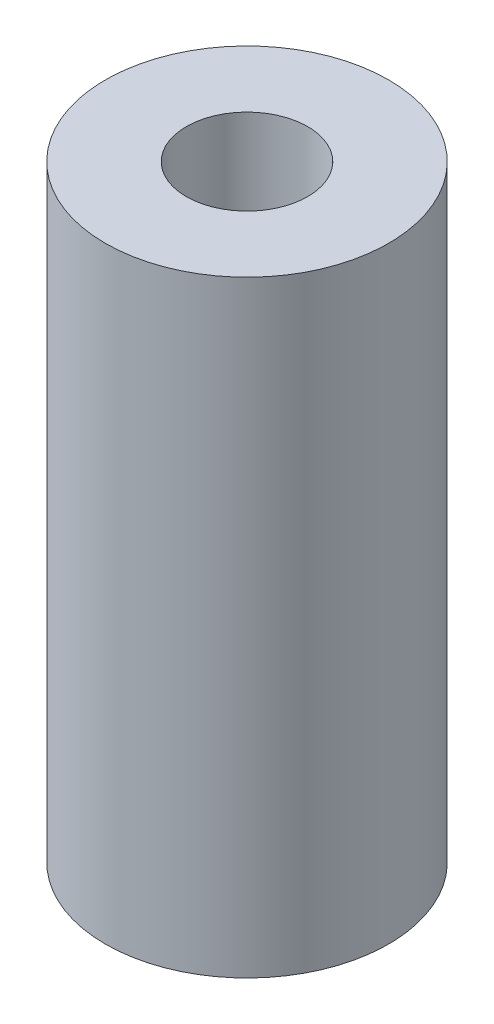
ISO-10303-21;
HEADER;
FILE_DESCRIPTION(('STEP AP214'),'2;1');
FILE_NAME('part.step','',(''),(''),'','','');
FILE_SCHEMA(('AUTOMOTIVE_DESIGN { 1 0 10303 214 1 1 1 1 }'));
ENDSEC;
DATA;
#1=APPLICATION_CONTEXT('core data for automotive mechanical design processes');
#2=APPLICATION_PROTOCOL_DEFINITION('international standard','automotive_design',2000,#1);
#3=PRODUCT_CONTEXT('',#1,'mechanical');
#4=PRODUCT('Part','Part','',(#3));
#5=PRODUCT_RELATED_PRODUCT_CATEGORY('part','',(#4));
#6=PRODUCT_DEFINITION_FORMATION('','',#4);
#7=PRODUCT_DEFINITION_CONTEXT('part definition',#1,'design');
#8=PRODUCT_DEFINITION('design','',#6,#7);
#9=PRODUCT_DEFINITION_SHAPE('','',#8);
#10=(LENGTH_UNIT() NAMED_UNIT(*) SI_UNIT(.MILLI.,.METRE.));
#11=(NAMED_UNIT(*) PLANE_ANGLE_UNIT() SI_UNIT($,.RADIAN.));
#12=(NAMED_UNIT(*) SI_UNIT($,.STERADIAN.) SOLID_ANGLE_UNIT());
#13=UNCERTAINTY_MEASURE_WITH_UNIT(LENGTH_MEASURE(1.E-05),#10,'distance_accuracy_value','');
#14=(GEOMETRIC_REPRESENTATION_CONTEXT(3) GLOBAL_UNCERTAINTY_ASSIGNED_CONTEXT((#13)) GLOBAL_UNIT_ASSIGNED_CONTEXT((#10,
#11,#12)) REPRESENTATION_CONTEXT('',''));
#15=CARTESIAN_POINT('',(0.,0.,0.));
#16=DIRECTION('',(0.,0.,1.));
#17=DIRECTION('',(1.,0.,0.));
#18=AXIS2_PLACEMENT_3D('',#15,#16,#17);
#19=CARTESIAN_POINT('',(0.,15.,0.));
#20=DIRECTION('',(0.,1.,0.));
#21=DIRECTION('',(0.,0.,1.));
#22=AXIS2_PLACEMENT_3D('',#19,#20,#21);
#23=PLANE('',#22);
#24=CARTESIAN_POINT('',(0.,15.,0.));
#25=DIRECTION('',(0.,1.,0.));
#26=DIRECTION('',(0.,0.,1.));
#27=AXIS2_PLACEMENT_3D('',#24,#25,#26);
#28=CIRCLE('',#27,3.5);
#29=CARTESIAN_POINT('',(0.,15.,3.5));
#30=VERTEX_POINT('',#29);
#31=EDGE_CURVE('E10',#30,#30,#28,.T.);
#32=ORIENTED_EDGE('',*,*,#31,.T.);
#33=EDGE_LOOP('',(#32));
#34=FACE_BOUND('',#33,.T.);
#35=CARTESIAN_POINT('',(0.,15.,0.));
#36=DIRECTION('',(0.,1.,0.));
#37=DIRECTION('',(0.,0.,1.));
#38=AXIS2_PLACEMENT_3D('',#35,#36,#37);
#39=CIRCLE('',#38,1.5);
#40=CARTESIAN_POINT('',(0.,15.,1.5));
#41=VERTEX_POINT('',#40);
#42=EDGE_CURVE('E43',#41,#41,#39,.T.);
#43=ORIENTED_EDGE('',*,*,#42,.F.);
#44=EDGE_LOOP('',(#43));
#45=FACE_BOUND('',#44,.T.);
#46=ADVANCED_FACE('F32',(#34,#45),#23,.T.);
#47=CARTESIAN_POINT('',(0.,0.,0.));
#48=DIRECTION('',(0.,1.,0.));
#49=DIRECTION('',(0.,0.,1.));
#50=AXIS2_PLACEMENT_3D('',#47,#48,#49);
#51=PLANE('',#50);
#52=CARTESIAN_POINT('',(0.,0.,0.));
#53=DIRECTION('',(0.,1.,0.));
#54=DIRECTION('',(0.,0.,1.));
#55=AXIS2_PLACEMENT_3D('',#52,#53,#54);
#56=CIRCLE('',#55,3.5);
#57=CARTESIAN_POINT('',(0.,0.,3.5));
#58=VERTEX_POINT('',#57);
#59=EDGE_CURVE('E36',#58,#58,#56,.T.);
#60=ORIENTED_EDGE('',*,*,#59,.F.);
#61=EDGE_LOOP('',(#60));
#62=FACE_BOUND('',#61,.T.);
#63=CARTESIAN_POINT('',(0.,0.,0.));
#64=DIRECTION('',(0.,1.,0.));
#65=DIRECTION('',(0.,0.,1.));
#66=AXIS2_PLACEMENT_3D('',#63,#64,#65);
#67=CIRCLE('',#66,1.5);
#68=CARTESIAN_POINT('',(0.,0.,1.5));
#69=VERTEX_POINT('',#68);
#70=EDGE_CURVE('E45',#69,#69,#67,.T.);
#71=ORIENTED_EDGE('',*,*,#70,.T.);
#72=EDGE_LOOP('',(#71));
#73=FACE_BOUND('',#72,.T.);
#74=ADVANCED_FACE('F55',(#62,#73),#51,.F.);
#75=CARTESIAN_POINT('',(0.,15.,0.));
#76=DIRECTION('',(0.,-1.,0.));
#77=DIRECTION('',(0.,0.,-1.));
#78=AXIS2_PLACEMENT_3D('',#75,#76,#77);
#79=CYLINDRICAL_SURFACE('',#78,3.5);
#80=ORIENTED_EDGE('',*,*,#31,.F.);
#81=EDGE_LOOP('',(#80));
#82=FACE_BOUND('',#81,.T.);
#83=ORIENTED_EDGE('',*,*,#59,.T.);
#84=EDGE_LOOP('',(#83));
#85=FACE_BOUND('',#84,.T.);
#86=ADVANCED_FACE('F34',(#82,#85),#79,.T.);
#87=CARTESIAN_POINT('',(0.,15.,0.));
#88=DIRECTION('',(0.,-1.,0.));
#89=DIRECTION('',(0.,0.,-1.));
#90=AXIS2_PLACEMENT_3D('',#87,#88,#89);
#91=CYLINDRICAL_SURFACE('',#90,1.5);
#92=ORIENTED_EDGE('',*,*,#42,.T.);
#93=EDGE_LOOP('',(#92));
#94=FACE_BOUND('',#93,.T.);
#95=ORIENTED_EDGE('',*,*,#70,.F.);
#96=EDGE_LOOP('',(#95));
#97=FACE_BOUND('',#96,.T.);
#98=ADVANCED_FACE('F51',(#94,#97),#91,.F.);
#99=CLOSED_SHELL('',(#46,#74,#86,#98));
#100=MANIFOLD_SOLID_BREP('B2',#99);
#101=ADVANCED_BREP_SHAPE_REPRESENTATION('',(#18,#100),#14);
#102=SHAPE_DEFINITION_REPRESENTATION(#9,#101);
ENDSEC;
END-ISO-10303-21;
